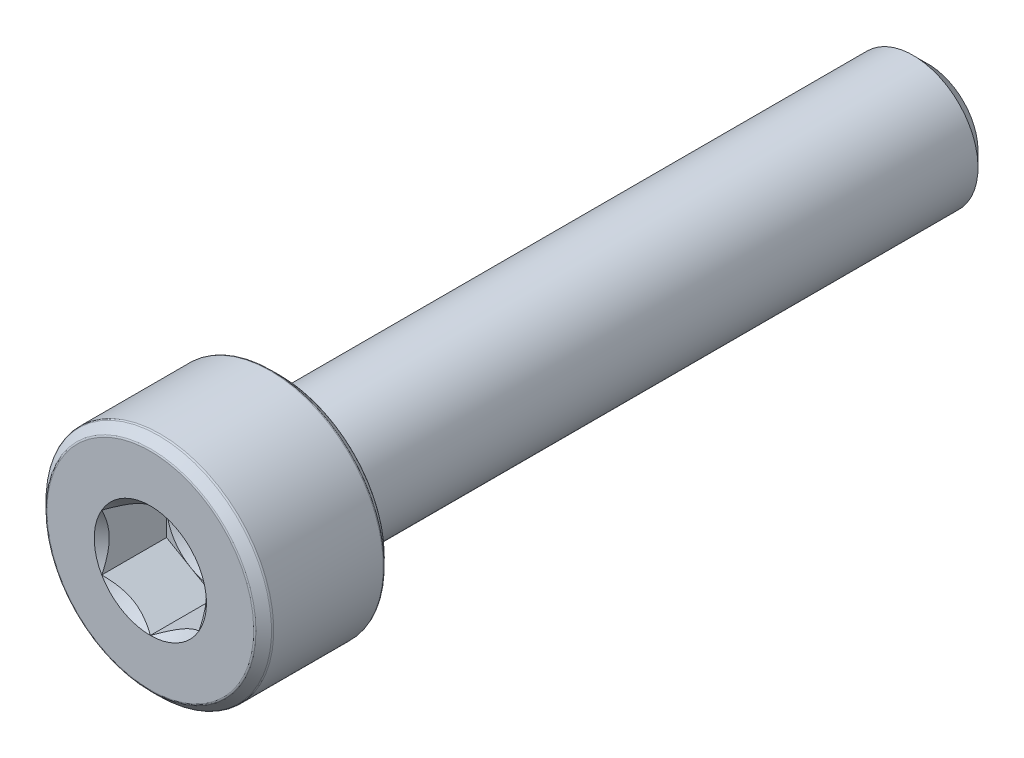
ISO-10303-21;
HEADER;
FILE_DESCRIPTION(('STEP AP214'),'2;1');
FILE_NAME('part.step','',(''),(''),'','','');
FILE_SCHEMA(('AUTOMOTIVE_DESIGN { 1 0 10303 214 1 1 1 1 }'));
ENDSEC;
DATA;
#1=APPLICATION_CONTEXT('core data for automotive mechanical design processes');
#2=APPLICATION_PROTOCOL_DEFINITION('international standard','automotive_design',2000,#1);
#3=PRODUCT_CONTEXT('',#1,'mechanical');
#4=PRODUCT('Part','Part','',(#3));
#5=PRODUCT_RELATED_PRODUCT_CATEGORY('part','',(#4));
#6=PRODUCT_DEFINITION_FORMATION('','',#4);
#7=PRODUCT_DEFINITION_CONTEXT('part definition',#1,'design');
#8=PRODUCT_DEFINITION('design','',#6,#7);
#9=PRODUCT_DEFINITION_SHAPE('','',#8);
#10=(LENGTH_UNIT() NAMED_UNIT(*) SI_UNIT(.MILLI.,.METRE.));
#11=(NAMED_UNIT(*) PLANE_ANGLE_UNIT() SI_UNIT($,.RADIAN.));
#12=(NAMED_UNIT(*) SI_UNIT($,.STERADIAN.) SOLID_ANGLE_UNIT());
#13=UNCERTAINTY_MEASURE_WITH_UNIT(LENGTH_MEASURE(1.E-05),#10,'distance_accuracy_value','');
#14=(GEOMETRIC_REPRESENTATION_CONTEXT(3) GLOBAL_UNCERTAINTY_ASSIGNED_CONTEXT((#13)) GLOBAL_UNIT_ASSIGNED_CONTEXT((#10,
#11,#12)) REPRESENTATION_CONTEXT('',''));
#15=CARTESIAN_POINT('',(0.,0.,0.));
#16=DIRECTION('',(0.,0.,1.));
#17=DIRECTION('',(1.,0.,0.));
#18=AXIS2_PLACEMENT_3D('',#15,#16,#17);
#19=CARTESIAN_POINT('',(0.,1.5,10.));
#20=DIRECTION('',(0.,0.,-1.));
#21=DIRECTION('',(0.,1.,0.));
#22=AXIS2_PLACEMENT_3D('',#19,#20,#21);
#23=PLANE('',#22);
#24=DIRECTION('',(-0.866025403784439,0.5,0.));
#25=VECTOR('',#24,1.);
#26=CARTESIAN_POINT('',(1.5,0.866025403784438,10.));
#27=LINE('',#26,#25);
#28=CARTESIAN_POINT('',(1.5,0.866025403784438,10.));
#29=VERTEX_POINT('',#28);
#30=CARTESIAN_POINT('',(0.749999999999999,1.29903810567666,10.));
#31=VERTEX_POINT('',#30);
#32=EDGE_CURVE('E315',#29,#31,#27,.T.);
#33=ORIENTED_EDGE('',*,*,#32,.T.);
#34=CARTESIAN_POINT('',(0.,0.,10.));
#35=DIRECTION('',(0.,0.,1.));
#36=DIRECTION('',(1.,0.,0.));
#37=AXIS2_PLACEMENT_3D('',#34,#35,#36);
#38=CIRCLE('',#37,1.5);
#39=CARTESIAN_POINT('',(1.5,0.,10.));
#40=VERTEX_POINT('',#39);
#41=EDGE_CURVE('E58',#40,#31,#38,.T.);
#42=ORIENTED_EDGE('',*,*,#41,.F.);
#43=DIRECTION('',(0.,1.,0.));
#44=VECTOR('',#43,1.);
#45=CARTESIAN_POINT('',(1.5,-0.866025403784438,10.));
#46=LINE('',#45,#44);
#47=EDGE_CURVE('E65',#40,#29,#46,.T.);
#48=ORIENTED_EDGE('',*,*,#47,.T.);
#49=EDGE_LOOP('',(#33,#42,#48));
#50=FACE_BOUND('',#49,.T.);
#51=ADVANCED_FACE('F41',(#50),#23,.F.);
#52=CARTESIAN_POINT('',(1.5,-0.866025403784438,10.));
#53=VERTEX_POINT('',#52);
#54=EDGE_CURVE('E195',#53,#40,#46,.T.);
#55=ORIENTED_EDGE('',*,*,#54,.T.);
#56=CARTESIAN_POINT('',(0.,0.,10.));
#57=DIRECTION('',(0.,0.,-1.));
#58=DIRECTION('',(0.,1.,0.));
#59=AXIS2_PLACEMENT_3D('',#56,#57,#58);
#60=CIRCLE('',#59,1.5);
#61=CARTESIAN_POINT('',(0.75,-1.29903810567666,10.));
#62=VERTEX_POINT('',#61);
#63=EDGE_CURVE('E11',#40,#62,#60,.T.);
#64=ORIENTED_EDGE('',*,*,#63,.T.);
#65=DIRECTION('',(0.866025403784439,0.5,0.));
#66=VECTOR('',#65,1.);
#67=CARTESIAN_POINT('',(0.,-1.73205080756888,10.));
#68=LINE('',#67,#66);
#69=EDGE_CURVE('E190',#62,#53,#68,.T.);
#70=ORIENTED_EDGE('',*,*,#69,.T.);
#71=EDGE_LOOP('',(#55,#64,#70));
#72=FACE_BOUND('',#71,.T.);
#73=ADVANCED_FACE('F129',(#72),#23,.F.);
#74=CARTESIAN_POINT('',(0.,-1.73205080756888,10.));
#75=VERTEX_POINT('',#74);
#76=EDGE_CURVE('E191',#75,#62,#68,.T.);
#77=ORIENTED_EDGE('',*,*,#76,.T.);
#78=CARTESIAN_POINT('',(-0.75,-1.29903810567666,10.));
#79=VERTEX_POINT('',#78);
#80=EDGE_CURVE('E51',#62,#79,#60,.T.);
#81=ORIENTED_EDGE('',*,*,#80,.T.);
#82=DIRECTION('',(0.866025403784439,-0.5,0.));
#83=VECTOR('',#82,1.);
#84=CARTESIAN_POINT('',(-1.5,-0.866025403784438,10.));
#85=LINE('',#84,#83);
#86=EDGE_CURVE('E177',#79,#75,#85,.T.);
#87=ORIENTED_EDGE('',*,*,#86,.T.);
#88=EDGE_LOOP('',(#77,#81,#87));
#89=FACE_BOUND('',#88,.T.);
#90=ADVANCED_FACE('F135',(#89),#23,.F.);
#91=CARTESIAN_POINT('',(-1.5,-0.866025403784438,10.));
#92=VERTEX_POINT('',#91);
#93=EDGE_CURVE('E182',#92,#79,#85,.T.);
#94=ORIENTED_EDGE('',*,*,#93,.T.);
#95=CARTESIAN_POINT('',(-1.5,0.,10.));
#96=VERTEX_POINT('',#95);
#97=EDGE_CURVE('E269',#79,#96,#60,.T.);
#98=ORIENTED_EDGE('',*,*,#97,.T.);
#99=DIRECTION('',(0.,-1.,0.));
#100=VECTOR('',#99,1.);
#101=CARTESIAN_POINT('',(-1.5,0.866025403784439,10.));
#102=LINE('',#101,#100);
#103=EDGE_CURVE('E178',#96,#92,#102,.T.);
#104=ORIENTED_EDGE('',*,*,#103,.T.);
#105=EDGE_LOOP('',(#94,#98,#104));
#106=FACE_BOUND('',#105,.T.);
#107=ADVANCED_FACE('F155',(#106),#23,.F.);
#108=CARTESIAN_POINT('',(-1.5,0.866025403784439,10.));
#109=VERTEX_POINT('',#108);
#110=EDGE_CURVE('E168',#109,#96,#102,.T.);
#111=ORIENTED_EDGE('',*,*,#110,.T.);
#112=CARTESIAN_POINT('',(-0.75,1.29903810567666,10.));
#113=VERTEX_POINT('',#112);
#114=EDGE_CURVE('E169',#96,#113,#60,.T.);
#115=ORIENTED_EDGE('',*,*,#114,.T.);
#116=DIRECTION('',(-0.866025403784439,-0.5,0.));
#117=VECTOR('',#116,1.);
#118=CARTESIAN_POINT('',(0.,1.73205080756888,10.));
#119=LINE('',#118,#117);
#120=EDGE_CURVE('E171',#113,#109,#119,.T.);
#121=ORIENTED_EDGE('',*,*,#120,.T.);
#122=EDGE_LOOP('',(#111,#115,#121));
#123=FACE_BOUND('',#122,.T.);
#124=ADVANCED_FACE('F142',(#123),#23,.F.);
#125=CARTESIAN_POINT('',(0.,3.19100505063389,12.));
#126=DIRECTION('',(0.,0.,-1.));
#127=DIRECTION('',(0.,1.,0.));
#128=AXIS2_PLACEMENT_3D('',#125,#126,#127);
#129=PLANE('',#128);
#130=CARTESIAN_POINT('',(0.,0.,12.));
#131=DIRECTION('',(0.,0.,1.));
#132=DIRECTION('',(1.,0.,0.));
#133=AXIS2_PLACEMENT_3D('',#130,#131,#132);
#134=CIRCLE('',#133,1.73205080756888);
#135=CARTESIAN_POINT('',(0.,1.73205080756888,12.));
#136=VERTEX_POINT('',#135);
#137=CARTESIAN_POINT('',(-1.5,0.866025403784439,12.));
#138=VERTEX_POINT('',#137);
#139=EDGE_CURVE('E292',#136,#138,#134,.T.);
#140=ORIENTED_EDGE('',*,*,#139,.F.);
#141=CARTESIAN_POINT('',(0.,0.,12.));
#142=DIRECTION('',(0.,0.,1.));
#143=DIRECTION('',(1.,0.,0.));
#144=AXIS2_PLACEMENT_3D('',#141,#142,#143);
#145=CIRCLE('',#144,1.73205080756888);
#146=CARTESIAN_POINT('',(1.5,0.866025403784438,12.));
#147=VERTEX_POINT('',#146);
#148=EDGE_CURVE('E386',#147,#136,#145,.T.);
#149=ORIENTED_EDGE('',*,*,#148,.F.);
#150=CARTESIAN_POINT('',(0.,0.,12.));
#151=DIRECTION('',(0.,0.,1.));
#152=DIRECTION('',(1.,0.,0.));
#153=AXIS2_PLACEMENT_3D('',#150,#151,#152);
#154=CIRCLE('',#153,1.73205080756888);
#155=CARTESIAN_POINT('',(1.5,-0.866025403784437,12.));
#156=VERTEX_POINT('',#155);
#157=EDGE_CURVE('E320',#156,#147,#154,.T.);
#158=ORIENTED_EDGE('',*,*,#157,.F.);
#159=CARTESIAN_POINT('',(0.,0.,12.));
#160=DIRECTION('',(0.,0.,1.));
#161=DIRECTION('',(1.,0.,0.));
#162=AXIS2_PLACEMENT_3D('',#159,#160,#161);
#163=CIRCLE('',#162,1.73205080756888);
#164=CARTESIAN_POINT('',(0.,-1.73205080756888,12.));
#165=VERTEX_POINT('',#164);
#166=EDGE_CURVE('E359',#165,#156,#163,.T.);
#167=ORIENTED_EDGE('',*,*,#166,.F.);
#168=CARTESIAN_POINT('',(0.,0.,12.));
#169=DIRECTION('',(0.,0.,1.));
#170=DIRECTION('',(1.,0.,0.));
#171=AXIS2_PLACEMENT_3D('',#168,#169,#170);
#172=CIRCLE('',#171,1.73205080756888);
#173=CARTESIAN_POINT('',(-1.5,-0.866025403784438,12.));
#174=VERTEX_POINT('',#173);
#175=EDGE_CURVE('E291',#174,#165,#172,.T.);
#176=ORIENTED_EDGE('',*,*,#175,.F.);
#177=CARTESIAN_POINT('',(0.,0.,12.));
#178=DIRECTION('',(0.,0.,1.));
#179=DIRECTION('',(1.,0.,0.));
#180=AXIS2_PLACEMENT_3D('',#177,#178,#179);
#181=CIRCLE('',#180,1.73205080756888);
#182=EDGE_CURVE('E376',#138,#174,#181,.T.);
#183=ORIENTED_EDGE('',*,*,#182,.F.);
#184=EDGE_LOOP('',(#140,#149,#158,#167,#176,#183));
#185=FACE_BOUND('',#184,.T.);
#186=CARTESIAN_POINT('',(0.,0.,12.));
#187=DIRECTION('',(0.,0.,1.));
#188=DIRECTION('',(0.,-1.,0.));
#189=AXIS2_PLACEMENT_3D('',#186,#187,#188);
#190=CIRCLE('',#189,3.19100505063388);
#191=CARTESIAN_POINT('',(0.,-3.19100505063388,12.));
#192=VERTEX_POINT('',#191);
#193=EDGE_CURVE('E261',#192,#192,#190,.T.);
#194=ORIENTED_EDGE('',*,*,#193,.T.);
#195=EDGE_LOOP('',(#194));
#196=FACE_BOUND('',#195,.T.);
#197=ADVANCED_FACE('F43',(#185,#196),#129,.F.);
#198=CARTESIAN_POINT('',(0.,0.,11.93));
#199=DIRECTION('',(0.,0.,1.));
#200=DIRECTION('',(0.,-1.,0.));
#201=AXIS2_PLACEMENT_3D('',#198,#199,#200);
#202=TOROIDAL_SURFACE('',#201,3.19100505063388,0.0699999999999999);
#203=ORIENTED_EDGE('',*,*,#193,.F.);
#204=EDGE_LOOP('',(#203));
#205=FACE_BOUND('',#204,.T.);
#206=CARTESIAN_POINT('',(0.,0.,11.9794974746831));
#207=DIRECTION('',(0.,0.,1.));
#208=DIRECTION('',(0.,-1.,0.));
#209=AXIS2_PLACEMENT_3D('',#206,#207,#208);
#210=CIRCLE('',#209,3.24050252531694);
#211=CARTESIAN_POINT('',(0.,-3.24050252531694,11.9794974746831));
#212=VERTEX_POINT('',#211);
#213=EDGE_CURVE('E258',#212,#212,#210,.T.);
#214=ORIENTED_EDGE('',*,*,#213,.T.);
#215=EDGE_LOOP('',(#214));
#216=FACE_BOUND('',#215,.T.);
#217=ADVANCED_FACE('F162',(#205,#216),#202,.T.);
#218=CARTESIAN_POINT('',(0.,0.,11.7405025253169));
#219=DIRECTION('',(0.,0.,-1.));
#220=DIRECTION('',(0.,1.,0.));
#221=AXIS2_PLACEMENT_3D('',#218,#219,#220);
#222=CONICAL_SURFACE('',#221,3.47949747468306,0.785398163397458);
#223=ORIENTED_EDGE('',*,*,#213,.F.);
#224=EDGE_LOOP('',(#223));
#225=FACE_BOUND('',#224,.T.);
#226=CARTESIAN_POINT('',(0.,0.,11.7405025253169));
#227=DIRECTION('',(0.,0.,1.));
#228=DIRECTION('',(0.,-1.,0.));
#229=AXIS2_PLACEMENT_3D('',#226,#227,#228);
#230=CIRCLE('',#229,3.47949747468306);
#231=CARTESIAN_POINT('',(0.,-3.47949747468306,11.7405025253169));
#232=VERTEX_POINT('',#231);
#233=EDGE_CURVE('E254',#232,#232,#230,.T.);
#234=ORIENTED_EDGE('',*,*,#233,.T.);
#235=EDGE_LOOP('',(#234));
#236=FACE_BOUND('',#235,.T.);
#237=ADVANCED_FACE('F546',(#225,#236),#222,.T.);
#238=CARTESIAN_POINT('',(0.,0.,11.6910050506339));
#239=DIRECTION('',(0.,0.,1.));
#240=DIRECTION('',(0.,-1.,0.));
#241=AXIS2_PLACEMENT_3D('',#238,#239,#240);
#242=TOROIDAL_SURFACE('',#241,3.43,0.0700000000000011);
#243=ORIENTED_EDGE('',*,*,#233,.F.);
#244=EDGE_LOOP('',(#243));
#245=FACE_BOUND('',#244,.T.);
#246=CARTESIAN_POINT('',(0.,0.,11.6910050506339));
#247=DIRECTION('',(0.,0.,1.));
#248=DIRECTION('',(0.,-1.,0.));
#249=AXIS2_PLACEMENT_3D('',#246,#247,#248);
#250=CIRCLE('',#249,3.5);
#251=CARTESIAN_POINT('',(0.,-3.5,11.6910050506339));
#252=VERTEX_POINT('',#251);
#253=EDGE_CURVE('E250',#252,#252,#250,.T.);
#254=ORIENTED_EDGE('',*,*,#253,.T.);
#255=EDGE_LOOP('',(#254));
#256=FACE_BOUND('',#255,.T.);
#257=ADVANCED_FACE('F538',(#245,#256),#242,.T.);
#258=CARTESIAN_POINT('',(0.,0.,12.));
#259=DIRECTION('',(0.,0.,1.));
#260=DIRECTION('',(0.,-1.,0.));
#261=AXIS2_PLACEMENT_3D('',#258,#259,#260);
#262=CYLINDRICAL_SURFACE('',#261,3.5);
#263=ORIENTED_EDGE('',*,*,#253,.F.);
#264=EDGE_LOOP('',(#263));
#265=FACE_BOUND('',#264,.T.);
#266=CARTESIAN_POINT('',(0.,0.,8.30899494936612));
#267=DIRECTION('',(0.,0.,1.));
#268=DIRECTION('',(0.,-1.,0.));
#269=AXIS2_PLACEMENT_3D('',#266,#267,#268);
#270=CIRCLE('',#269,3.5);
#271=CARTESIAN_POINT('',(0.,-3.5,8.30899494936612));
#272=VERTEX_POINT('',#271);
#273=EDGE_CURVE('E246',#272,#272,#270,.T.);
#274=ORIENTED_EDGE('',*,*,#273,.T.);
#275=EDGE_LOOP('',(#274));
#276=FACE_BOUND('',#275,.T.);
#277=ADVANCED_FACE('F530',(#265,#276),#262,.T.);
#278=CARTESIAN_POINT('',(0.,0.,8.30899494936611));
#279=DIRECTION('',(0.,0.,1.));
#280=DIRECTION('',(0.,-1.,0.));
#281=AXIS2_PLACEMENT_3D('',#278,#279,#280);
#282=TOROIDAL_SURFACE('',#281,3.43,0.0699999999999992);
#283=ORIENTED_EDGE('',*,*,#273,.F.);
#284=EDGE_LOOP('',(#283));
#285=FACE_BOUND('',#284,.T.);
#286=CARTESIAN_POINT('',(0.,0.,8.25949747468306));
#287=DIRECTION('',(0.,0.,1.));
#288=DIRECTION('',(0.,-1.,0.));
#289=AXIS2_PLACEMENT_3D('',#286,#287,#288);
#290=CIRCLE('',#289,3.47949747468306);
#291=CARTESIAN_POINT('',(0.,-3.47949747468306,8.25949747468306));
#292=VERTEX_POINT('',#291);
#293=EDGE_CURVE('E242',#292,#292,#290,.T.);
#294=ORIENTED_EDGE('',*,*,#293,.T.);
#295=EDGE_LOOP('',(#294));
#296=FACE_BOUND('',#295,.T.);
#297=ADVANCED_FACE('F522',(#285,#296),#282,.T.);
#298=CARTESIAN_POINT('',(0.,0.,8.02050252531694));
#299=DIRECTION('',(0.,0.,1.));
#300=DIRECTION('',(0.,-1.,0.));
#301=AXIS2_PLACEMENT_3D('',#298,#299,#300);
#302=CONICAL_SURFACE('',#301,3.24050252531694,0.785398163397452);
#303=ORIENTED_EDGE('',*,*,#293,.F.);
#304=EDGE_LOOP('',(#303));
#305=FACE_BOUND('',#304,.T.);
#306=CARTESIAN_POINT('',(0.,0.,8.02050252531694));
#307=DIRECTION('',(0.,0.,1.));
#308=DIRECTION('',(0.,-1.,0.));
#309=AXIS2_PLACEMENT_3D('',#306,#307,#308);
#310=CIRCLE('',#309,3.24050252531694);
#311=CARTESIAN_POINT('',(0.,-3.24050252531694,8.02050252531694));
#312=VERTEX_POINT('',#311);
#313=EDGE_CURVE('E238',#312,#312,#310,.T.);
#314=ORIENTED_EDGE('',*,*,#313,.T.);
#315=EDGE_LOOP('',(#314));
#316=FACE_BOUND('',#315,.T.);
#317=ADVANCED_FACE('F514',(#305,#316),#302,.T.);
#318=CARTESIAN_POINT('',(0.,0.,8.07));
#319=DIRECTION('',(0.,0.,1.));
#320=DIRECTION('',(0.,-1.,0.));
#321=AXIS2_PLACEMENT_3D('',#318,#319,#320);
#322=TOROIDAL_SURFACE('',#321,3.19100505063389,0.0699999999999983);
#323=ORIENTED_EDGE('',*,*,#313,.F.);
#324=EDGE_LOOP('',(#323));
#325=FACE_BOUND('',#324,.T.);
#326=CARTESIAN_POINT('',(0.,0.,8.));
#327=DIRECTION('',(0.,0.,1.));
#328=DIRECTION('',(0.,-1.,0.));
#329=AXIS2_PLACEMENT_3D('',#326,#327,#328);
#330=CIRCLE('',#329,3.19100505063389);
#331=CARTESIAN_POINT('',(0.,-3.19100505063389,8.));
#332=VERTEX_POINT('',#331);
#333=EDGE_CURVE('E234',#332,#332,#330,.T.);
#334=ORIENTED_EDGE('',*,*,#333,.T.);
#335=EDGE_LOOP('',(#334));
#336=FACE_BOUND('',#335,.T.);
#337=ADVANCED_FACE('F506',(#325,#336),#322,.T.);
#338=CARTESIAN_POINT('',(0.,2.,8.));
#339=DIRECTION('',(0.,0.,1.));
#340=DIRECTION('',(0.,-1.,0.));
#341=AXIS2_PLACEMENT_3D('',#338,#339,#340);
#342=PLANE('',#341);
#343=ORIENTED_EDGE('',*,*,#333,.F.);
#344=EDGE_LOOP('',(#343));
#345=FACE_BOUND('',#344,.T.);
#346=CARTESIAN_POINT('',(0.,0.,8.));
#347=DIRECTION('',(0.,0.,1.));
#348=DIRECTION('',(0.,-1.,0.));
#349=AXIS2_PLACEMENT_3D('',#346,#347,#348);
#350=CIRCLE('',#349,2.);
#351=CARTESIAN_POINT('',(0.,-2.,8.));
#352=VERTEX_POINT('',#351);
#353=EDGE_CURVE('E230',#352,#352,#350,.T.);
#354=ORIENTED_EDGE('',*,*,#353,.T.);
#355=EDGE_LOOP('',(#354));
#356=FACE_BOUND('',#355,.T.);
#357=ADVANCED_FACE('F498',(#345,#356),#342,.F.);
#358=CARTESIAN_POINT('',(0.,0.,12.));
#359=DIRECTION('',(0.,0.,1.));
#360=DIRECTION('',(0.,-1.,0.));
#361=AXIS2_PLACEMENT_3D('',#358,#359,#360);
#362=CYLINDRICAL_SURFACE('',#361,2.);
#363=ORIENTED_EDGE('',*,*,#353,.F.);
#364=EDGE_LOOP('',(#363));
#365=FACE_BOUND('',#364,.T.);
#366=CARTESIAN_POINT('',(0.,0.,-11.5453366630132));
#367=DIRECTION('',(0.,0.,1.));
#368=DIRECTION('',(0.,-1.,0.));
#369=AXIS2_PLACEMENT_3D('',#366,#367,#368);
#370=CIRCLE('',#369,2.);
#371=CARTESIAN_POINT('',(0.,-2.,-11.5453366630132));
#372=VERTEX_POINT('',#371);
#373=EDGE_CURVE('E226',#372,#372,#370,.T.);
#374=ORIENTED_EDGE('',*,*,#373,.T.);
#375=EDGE_LOOP('',(#374));
#376=FACE_BOUND('',#375,.T.);
#377=ADVANCED_FACE('F490',(#365,#376),#362,.T.);
#378=CARTESIAN_POINT('',(0.,0.,-12.));
#379=DIRECTION('',(0.,0.,1.));
#380=DIRECTION('',(0.,-1.,0.));
#381=AXIS2_PLACEMENT_3D('',#378,#379,#380);
#382=CONICAL_SURFACE('',#381,1.54533666301317,0.785398163397448);
#383=ORIENTED_EDGE('',*,*,#373,.F.);
#384=EDGE_LOOP('',(#383));
#385=FACE_BOUND('',#384,.T.);
#386=CARTESIAN_POINT('',(0.,0.,-12.));
#387=DIRECTION('',(0.,0.,1.));
#388=DIRECTION('',(0.,-1.,0.));
#389=AXIS2_PLACEMENT_3D('',#386,#387,#388);
#390=CIRCLE('',#389,1.54533666301317);
#391=CARTESIAN_POINT('',(0.,-1.54533666301316,-12.));
#392=VERTEX_POINT('',#391);
#393=EDGE_CURVE('E204',#392,#392,#390,.T.);
#394=ORIENTED_EDGE('',*,*,#393,.T.);
#395=EDGE_LOOP('',(#394));
#396=FACE_BOUND('',#395,.T.);
#397=ADVANCED_FACE('F482',(#385,#396),#382,.T.);
#398=CARTESIAN_POINT('',(0.,0.,-12.));
#399=DIRECTION('',(0.,0.,1.));
#400=DIRECTION('',(0.,-1.,0.));
#401=AXIS2_PLACEMENT_3D('',#398,#399,#400);
#402=PLANE('',#401);
#403=ORIENTED_EDGE('',*,*,#393,.F.);
#404=EDGE_LOOP('',(#403));
#405=FACE_BOUND('',#404,.T.);
#406=ADVANCED_FACE('F478',(#405),#402,.F.);
#407=CARTESIAN_POINT('',(1.5,0.866025403784438,10.));
#408=DIRECTION('',(0.5,0.866025403784439,0.));
#409=DIRECTION('',(-0.866025403784439,0.5,0.));
#410=AXIS2_PLACEMENT_3D('',#407,#408,#409);
#411=PLANE('',#410);
#412=DIRECTION('',(0.,0.,1.));
#413=VECTOR('',#412,1.);
#414=CARTESIAN_POINT('',(1.5,0.866025403784438,10.));
#415=LINE('',#414,#413);
#416=EDGE_CURVE('E200',#29,#147,#415,.T.);
#417=ORIENTED_EDGE('',*,*,#416,.T.);
#418=CARTESIAN_POINT('',(-0.0002,1.73216627762271,12.0001154816001));
#419=CARTESIAN_POINT('',(0.0513677907370755,1.70239359975915,11.9703654760673));
#420=CARTESIAN_POINT('',(0.103797917665201,1.67212305186355,11.9423624839103));
#421=CARTESIAN_POINT('',(0.210709034055597,1.61039789003619,11.8910892304401));
#422=CARTESIAN_POINT('',(0.265200195814661,1.57893740312614,11.8678475050444));
#423=CARTESIAN_POINT('',(0.375079081357249,1.51549879897987,11.8280337289922));
#424=CARTESIAN_POINT('',(0.4304388090952,1.4835368452681,11.8113615856709));
#425=CARTESIAN_POINT('',(0.542377257477151,1.41890915196211,11.7856744568181));
#426=CARTESIAN_POINT('',(0.598952556553009,1.38624538781118,11.7766402904789));
#427=CARTESIAN_POINT('',(0.696455389516441,1.32995210095299,11.7684890812269));
#428=CARTESIAN_POINT('',(0.737256908280466,1.30639533311124,11.7672822529892));
#429=CARTESIAN_POINT('',(0.818787969615858,1.25932335290193,11.7693140571623));
#430=CARTESIAN_POINT('',(0.85951749431463,1.23580815085313,11.7725536707483));
#431=CARTESIAN_POINT('',(0.940584402163416,1.18900414978427,11.783291985982));
#432=CARTESIAN_POINT('',(0.980921384598288,1.16571558211719,11.7907946530187));
#433=CARTESIAN_POINT('',(1.06091833691403,1.11952932016335,11.8096516119283));
#434=CARTESIAN_POINT('',(1.10057800851621,1.09663179808786,11.8210075570186));
#435=CARTESIAN_POINT('',(1.20216313477448,1.03798159809698,11.8547216475927));
#436=CARTESIAN_POINT('',(1.26345855370969,1.00259267147465,11.8796218490934));
#437=CARTESIAN_POINT('',(1.35358562846331,0.950557780604374,11.9216566532716));
#438=CARTESIAN_POINT('',(1.38328513990772,0.933410759677147,11.9364251535591));
#439=CARTESIAN_POINT('',(1.44213790138375,0.899432101996406,11.9673105659402));
#440=CARTESIAN_POINT('',(1.47129140422064,0.882600319285709,11.9834268341217));
#441=CARTESIAN_POINT('',(1.5002,0.865909933730601,12.0001154816001));
#442=B_SPLINE_CURVE_WITH_KNOTS('',3,(#418,#419,#420,#421,#422,#423,#424,#425,#426,#427,#428,
#429,#430,#431,#432,#433,#434,#435,#436,#437,#438,#439,#440,#441),.UNSPECIFIED.,.F.,.F.,(4,2,2,
2,2,2,2,2,2,2,2,4),(0.,0.199829143693305,0.400822987382389,0.598623720538181,0.795926240188889,
0.937113067959881,1.07833105577193,1.21968061668222,1.36109089931054,1.58570969637565,
1.69770705470964,1.80965120737194),.UNSPECIFIED.);
#443=EDGE_CURVE('E313',#136,#147,#442,.T.);
#444=ORIENTED_EDGE('',*,*,#443,.F.);
#445=DIRECTION('',(0.,0.,1.));
#446=VECTOR('',#445,1.);
#447=CARTESIAN_POINT('',(0.,1.73205080756888,10.));
#448=LINE('',#447,#446);
#449=CARTESIAN_POINT('',(0.,1.73205080756888,10.));
#450=VERTEX_POINT('',#449);
#451=EDGE_CURVE('E199',#450,#136,#448,.T.);
#452=ORIENTED_EDGE('',*,*,#451,.F.);
#453=EDGE_CURVE('E316',#31,#450,#27,.T.);
#454=ORIENTED_EDGE('',*,*,#453,.F.);
#455=ORIENTED_EDGE('',*,*,#32,.F.);
#456=EDGE_LOOP('',(#417,#444,#452,#454,#455));
#457=FACE_BOUND('',#456,.T.);
#458=ADVANCED_FACE('F311',(#457),#411,.F.);
#459=CARTESIAN_POINT('',(1.5,-0.866025403784438,10.));
#460=DIRECTION('',(1.,0.,0.));
#461=DIRECTION('',(0.,1.,0.));
#462=AXIS2_PLACEMENT_3D('',#459,#460,#461);
#463=PLANE('',#462);
#464=DIRECTION('',(0.,0.,1.));
#465=VECTOR('',#464,1.);
#466=CARTESIAN_POINT('',(1.5,-0.866025403784438,10.));
#467=LINE('',#466,#465);
#468=EDGE_CURVE('E205',#53,#156,#467,.T.);
#469=ORIENTED_EDGE('',*,*,#468,.T.);
#470=CARTESIAN_POINT('',(1.5,-1.72720812969692,12.5555785162708));
#471=CARTESIAN_POINT('',(1.5,-1.68515175699268,12.5238299078574));
#472=CARTESIAN_POINT('',(1.5,-1.64286104748673,12.4923925938074));
#473=CARTESIAN_POINT('',(1.5,-1.55771581035942,12.4302690875564));
#474=CARTESIAN_POINT('',(1.5,-1.51486114386668,12.3995830858922));
#475=CARTESIAN_POINT('',(1.5,-1.3846813415127,12.3084071924272));
#476=CARTESIAN_POINT('',(1.5,-1.29637976071653,12.2492883434268));
#477=CARTESIAN_POINT('',(1.5,-1.11121478730467,12.1332309963165));
#478=CARTESIAN_POINT('',(1.5,-1.01415038238167,12.076609558733));
#479=CARTESIAN_POINT('',(1.5,-0.815173408897604,11.9730368812657));
#480=CARTESIAN_POINT('',(1.5,-0.713278669253284,11.9260530415417));
#481=CARTESIAN_POINT('',(1.5,-0.56033377494311,11.8685726684308));
#482=CARTESIAN_POINT('',(1.5,-0.511547982948041,11.8520753877572));
#483=CARTESIAN_POINT('',(1.5,-0.412798620136866,11.822997512927));
#484=CARTESIAN_POINT('',(1.5,-0.362834968437562,11.810417188594));
#485=CARTESIAN_POINT('',(1.5,-0.262863235444981,11.7900361941468));
#486=CARTESIAN_POINT('',(1.5,-0.212872113808022,11.782153632746));
#487=CARTESIAN_POINT('',(1.5,-0.112355243569545,11.771322063969));
#488=CARTESIAN_POINT('',(1.5,-0.0618295883726282,11.7683722085244));
#489=CARTESIAN_POINT('',(1.5,0.0374291733323837,11.7676248577249));
#490=CARTESIAN_POINT('',(1.5,0.0861609672002986,11.7696447335581));
#491=CARTESIAN_POINT('',(1.5,0.183206937768827,11.7783225528968));
#492=CARTESIAN_POINT('',(1.5,0.231521073438269,11.7849809469685));
#493=CARTESIAN_POINT('',(1.5,0.328199853425436,11.8026852441226));
#494=CARTESIAN_POINT('',(1.5,0.376550616310328,11.813805811257));
#495=CARTESIAN_POINT('',(1.5,0.472195697125598,11.8398434140487));
#496=CARTESIAN_POINT('',(1.5,0.51949010309274,11.8547601320409));
#497=CARTESIAN_POINT('',(1.5,0.668391282696624,11.9073352235961));
#498=CARTESIAN_POINT('',(1.5,0.767878709508552,11.950981287472));
#499=CARTESIAN_POINT('',(1.5,0.962179866690723,12.0480229945931));
#500=CARTESIAN_POINT('',(1.5,1.05697519961444,12.1014536650895));
#501=CARTESIAN_POINT('',(1.5,1.23814273533383,12.2116858520046));
#502=CARTESIAN_POINT('',(1.5,1.3246994218129,12.2681879206986));
#503=CARTESIAN_POINT('',(1.5,1.45222331290673,12.3555343015787));
#504=CARTESIAN_POINT('',(1.5,1.49418091978756,12.38495775868));
#505=CARTESIAN_POINT('',(1.5,1.57752272931476,12.4445828218305));
#506=CARTESIAN_POINT('',(1.5,1.61890708647354,12.4747842116644));
#507=CARTESIAN_POINT('',(1.5,1.66005278019494,12.5053081786095));
#508=B_SPLINE_CURVE_WITH_KNOTS('',3,(#470,#471,#472,#473,#474,#475,#476,#477,#478,#479,#480,
#481,#482,#483,#484,#485,#486,#487,#488,#489,#490,#491,#492,#493,#494,#495,#496,#497,#498,#499,
#500,#501,#502,#503,#504,#505,#506,#507),.UNSPECIFIED.,.F.,.F.,(4,2,2,2,2,2,2,2,2,2,2,2,2,2,2,2,
2,2,4),(0.,0.158079548982667,0.316198780993941,0.634850417346958,0.971690311361509,
1.30737131660667,1.46173961127089,1.61611853740677,1.76772101421409,1.91929742368538,
2.065387412096,2.21149159305544,2.36014984633872,2.50879566386709,2.83376031422673,
3.15991186985651,3.46985601802197,3.62358896039973,3.7772796264207),.UNSPECIFIED.);
#509=EDGE_CURVE('E308',#147,#156,#508,.F.);
#510=ORIENTED_EDGE('',*,*,#509,.F.);
#511=ORIENTED_EDGE('',*,*,#416,.F.);
#512=ORIENTED_EDGE('',*,*,#47,.F.);
#513=ORIENTED_EDGE('',*,*,#54,.F.);
#514=EDGE_LOOP('',(#469,#510,#511,#512,#513));
#515=FACE_BOUND('',#514,.T.);
#516=ADVANCED_FACE('F305',(#515),#463,.F.);
#517=CARTESIAN_POINT('',(0.,-1.73205080756888,10.));
#518=DIRECTION('',(0.5,-0.866025403784439,0.));
#519=DIRECTION('',(0.866025403784439,0.5,0.));
#520=AXIS2_PLACEMENT_3D('',#517,#518,#519);
#521=PLANE('',#520);
#522=DIRECTION('',(0.,0.,1.));
#523=VECTOR('',#522,1.);
#524=CARTESIAN_POINT('',(0.,-1.73205080756888,10.));
#525=LINE('',#524,#523);
#526=EDGE_CURVE('E209',#75,#165,#525,.T.);
#527=ORIENTED_EDGE('',*,*,#526,.T.);
#528=CARTESIAN_POINT('',(1.5002,-0.8659099337306,12.0001154816001));
#529=CARTESIAN_POINT('',(1.44863220926292,-0.895682611594165,11.9703654760673));
#530=CARTESIAN_POINT('',(1.3962020823348,-0.925953159489764,11.9423624839103));
#531=CARTESIAN_POINT('',(1.2892909659444,-0.987678321317123,11.8910892304401));
#532=CARTESIAN_POINT('',(1.23479980418534,-1.01913880822717,11.8678475050444));
#533=CARTESIAN_POINT('',(1.12492091864275,-1.08257741237344,11.8280337289922));
#534=CARTESIAN_POINT('',(1.0695611909048,-1.11453936608521,11.8113615856709));
#535=CARTESIAN_POINT('',(0.957622742522849,-1.1791670593912,11.7856744568181));
#536=CARTESIAN_POINT('',(0.901047443446991,-1.21183082354213,11.7766402904789));
#537=CARTESIAN_POINT('',(0.803544610483559,-1.26812411040032,11.7684890812269));
#538=CARTESIAN_POINT('',(0.762743091719533,-1.29168087824208,11.7672822529892));
#539=CARTESIAN_POINT('',(0.681212030384142,-1.33875285845138,11.7693140571623));
#540=CARTESIAN_POINT('',(0.64048250568537,-1.36226806050018,11.7725536707483));
#541=CARTESIAN_POINT('',(0.559415597836584,-1.40907206156905,11.783291985982));
#542=CARTESIAN_POINT('',(0.519078615401711,-1.43236062923612,11.7907946530187));
#543=CARTESIAN_POINT('',(0.439081663085969,-1.47854689118996,11.8096516119283));
#544=CARTESIAN_POINT('',(0.399421991483792,-1.50144441326545,11.8210075570186));
#545=CARTESIAN_POINT('',(0.297836865225515,-1.56009461325633,11.8547216475927));
#546=CARTESIAN_POINT('',(0.236541446290311,-1.59548353987866,11.8796218490934));
#547=CARTESIAN_POINT('',(0.146414371536687,-1.64751843074894,11.9216566532716));
#548=CARTESIAN_POINT('',(0.116714860092283,-1.66466545167617,11.9364251535591));
#549=CARTESIAN_POINT('',(0.0578620986162495,-1.69864410935691,11.9673105659402));
#550=CARTESIAN_POINT('',(0.0287085957793629,-1.7154758920676,11.9834268341217));
#551=CARTESIAN_POINT('',(-0.000200000000000305,-1.73216627762271,12.0001154816001));
#552=B_SPLINE_CURVE_WITH_KNOTS('',3,(#528,#529,#530,#531,#532,#533,#534,#535,#536,#537,#538,
#539,#540,#541,#542,#543,#544,#545,#546,#547,#548,#549,#550,#551),.UNSPECIFIED.,.F.,.F.,(4,2,2,
2,2,2,2,2,2,2,2,4),(0.,0.199829143693304,0.400822987382388,0.59862372053818,0.795926240188889,
0.93711306795988,1.07833105577193,1.21968061668222,1.36109089931054,1.58570969637565,
1.69770705470963,1.80965120737194),.UNSPECIFIED.);
#553=EDGE_CURVE('E298',#156,#165,#552,.T.);
#554=ORIENTED_EDGE('',*,*,#553,.F.);
#555=ORIENTED_EDGE('',*,*,#468,.F.);
#556=ORIENTED_EDGE('',*,*,#69,.F.);
#557=ORIENTED_EDGE('',*,*,#76,.F.);
#558=EDGE_LOOP('',(#527,#554,#555,#556,#557));
#559=FACE_BOUND('',#558,.T.);
#560=ADVANCED_FACE('F296',(#559),#521,.F.);
#561=CARTESIAN_POINT('',(-1.5,-0.866025403784438,10.));
#562=DIRECTION('',(-0.5,-0.866025403784439,0.));
#563=DIRECTION('',(0.866025403784439,-0.5,0.));
#564=AXIS2_PLACEMENT_3D('',#561,#562,#563);
#565=PLANE('',#564);
#566=DIRECTION('',(0.,0.,1.));
#567=VECTOR('',#566,1.);
#568=CARTESIAN_POINT('',(-1.5,-0.866025403784438,10.));
#569=LINE('',#568,#567);
#570=EDGE_CURVE('E213',#92,#174,#569,.T.);
#571=ORIENTED_EDGE('',*,*,#570,.T.);
#572=CARTESIAN_POINT('',(0.000199999999999356,-1.73216627762271,12.0001154816001));
#573=CARTESIAN_POINT('',(-0.0513677907370763,-1.70239359975915,11.9703654760673));
#574=CARTESIAN_POINT('',(-0.103797917665201,-1.67212305186355,11.9423624839103));
#575=CARTESIAN_POINT('',(-0.210709034055597,-1.61039789003619,11.8910892304401));
#576=CARTESIAN_POINT('',(-0.265200195814661,-1.57893740312614,11.8678475050444));
#577=CARTESIAN_POINT('',(-0.375079081357249,-1.51549879897987,11.8280337289922));
#578=CARTESIAN_POINT('',(-0.4304388090952,-1.4835368452681,11.8113615856709));
#579=CARTESIAN_POINT('',(-0.542377257477151,-1.41890915196211,11.7856744568181));
#580=CARTESIAN_POINT('',(-0.598952556553009,-1.38624538781118,11.7766402904789));
#581=CARTESIAN_POINT('',(-0.696455389516441,-1.32995210095299,11.7684890812269));
#582=CARTESIAN_POINT('',(-0.737256908280467,-1.30639533311124,11.7672822529892));
#583=CARTESIAN_POINT('',(-0.818787969615859,-1.25932335290193,11.7693140571623));
#584=CARTESIAN_POINT('',(-0.85951749431463,-1.23580815085313,11.7725536707483));
#585=CARTESIAN_POINT('',(-0.940584402163416,-1.18900414978427,11.783291985982));
#586=CARTESIAN_POINT('',(-0.980921384598288,-1.16571558211719,11.7907946530187));
#587=CARTESIAN_POINT('',(-1.06091833691403,-1.11952932016335,11.8096516119283));
#588=CARTESIAN_POINT('',(-1.10057800851621,-1.09663179808786,11.8210075570186));
#589=CARTESIAN_POINT('',(-1.20216313477448,-1.03798159809698,11.8547216475927));
#590=CARTESIAN_POINT('',(-1.26345855370969,-1.00259267147465,11.8796218490934));
#591=CARTESIAN_POINT('',(-1.35358562846331,-0.950557780604374,11.9216566532716));
#592=CARTESIAN_POINT('',(-1.38328513990772,-0.933410759677147,11.9364251535591));
#593=CARTESIAN_POINT('',(-1.44213790138375,-0.899432101996407,11.9673105659402));
#594=CARTESIAN_POINT('',(-1.47129140422064,-0.88260031928571,11.9834268341217));
#595=CARTESIAN_POINT('',(-1.5002,-0.8659099337306,12.0001154816001));
#596=B_SPLINE_CURVE_WITH_KNOTS('',3,(#572,#573,#574,#575,#576,#577,#578,#579,#580,#581,#582,
#583,#584,#585,#586,#587,#588,#589,#590,#591,#592,#593,#594,#595),.UNSPECIFIED.,.F.,.F.,(4,2,2,
2,2,2,2,2,2,2,2,4),(0.,0.199829143693305,0.400822987382388,0.59862372053818,0.795926240188889,
0.937113067959881,1.07833105577193,1.21968061668222,1.36109089931054,1.58570969637565,
1.69770705470963,1.80965120737193),.UNSPECIFIED.);
#597=EDGE_CURVE('E286',#165,#174,#596,.T.);
#598=ORIENTED_EDGE('',*,*,#597,.F.);
#599=ORIENTED_EDGE('',*,*,#526,.F.);
#600=ORIENTED_EDGE('',*,*,#86,.F.);
#601=ORIENTED_EDGE('',*,*,#93,.F.);
#602=EDGE_LOOP('',(#571,#598,#599,#600,#601));
#603=FACE_BOUND('',#602,.T.);
#604=ADVANCED_FACE('F280',(#603),#565,.F.);
#605=CARTESIAN_POINT('',(-1.5,0.866025403784439,10.));
#606=DIRECTION('',(-1.,0.,0.));
#607=DIRECTION('',(0.,-1.,0.));
#608=AXIS2_PLACEMENT_3D('',#605,#606,#607);
#609=PLANE('',#608);
#610=DIRECTION('',(0.,0.,1.));
#611=VECTOR('',#610,1.);
#612=CARTESIAN_POINT('',(-1.5,0.866025403784439,10.));
#613=LINE('',#612,#611);
#614=EDGE_CURVE('E217',#109,#138,#613,.T.);
#615=ORIENTED_EDGE('',*,*,#614,.T.);
#616=CARTESIAN_POINT('',(-1.5,-1.72720812969692,12.5555785162708));
#617=CARTESIAN_POINT('',(-1.5,-1.68515175699268,12.5238299078574));
#618=CARTESIAN_POINT('',(-1.5,-1.64286104748673,12.4923925938074));
#619=CARTESIAN_POINT('',(-1.5,-1.55771581035942,12.4302690875564));
#620=CARTESIAN_POINT('',(-1.5,-1.51486114386668,12.3995830858922));
#621=CARTESIAN_POINT('',(-1.5,-1.3846813415127,12.3084071924272));
#622=CARTESIAN_POINT('',(-1.5,-1.29637976071654,12.2492883434268));
#623=CARTESIAN_POINT('',(-1.5,-1.11121478730467,12.1332309963165));
#624=CARTESIAN_POINT('',(-1.5,-1.01415038238167,12.076609558733));
#625=CARTESIAN_POINT('',(-1.5,-0.815173408897606,11.9730368812657));
#626=CARTESIAN_POINT('',(-1.5,-0.713278669253285,11.9260530415417));
#627=CARTESIAN_POINT('',(-1.5,-0.560333774943112,11.8685726684308));
#628=CARTESIAN_POINT('',(-1.5,-0.511547982948042,11.8520753877573));
#629=CARTESIAN_POINT('',(-1.5,-0.412798620136866,11.822997512927));
#630=CARTESIAN_POINT('',(-1.5,-0.362834968437562,11.810417188594));
#631=CARTESIAN_POINT('',(-1.5,-0.262863235444982,11.7900361941468));
#632=CARTESIAN_POINT('',(-1.5,-0.212872113808022,11.782153632746));
#633=CARTESIAN_POINT('',(-1.5,-0.112355243569545,11.771322063969));
#634=CARTESIAN_POINT('',(-1.5,-0.0618295883726281,11.7683722085244));
#635=CARTESIAN_POINT('',(-1.5,0.0374291733323839,11.7676248577249));
#636=CARTESIAN_POINT('',(-1.5,0.0861609672002989,11.7696447335581));
#637=CARTESIAN_POINT('',(-1.5,0.183206937768827,11.7783225528968));
#638=CARTESIAN_POINT('',(-1.5,0.231521073438269,11.7849809469685));
#639=CARTESIAN_POINT('',(-1.5,0.328199853425436,11.8026852441226));
#640=CARTESIAN_POINT('',(-1.5,0.376550616310328,11.813805811257));
#641=CARTESIAN_POINT('',(-1.5,0.472195697125599,11.8398434140487));
#642=CARTESIAN_POINT('',(-1.5,0.519490103092741,11.8547601320409));
#643=CARTESIAN_POINT('',(-1.5,0.668391282696624,11.9073352235961));
#644=CARTESIAN_POINT('',(-1.5,0.767878709508553,11.950981287472));
#645=CARTESIAN_POINT('',(-1.5,0.962179866690724,12.0480229945931));
#646=CARTESIAN_POINT('',(-1.5,1.05697519961444,12.1014536650895));
#647=CARTESIAN_POINT('',(-1.5,1.23814273533383,12.2116858520046));
#648=CARTESIAN_POINT('',(-1.5,1.3246994218129,12.2681879206986));
#649=CARTESIAN_POINT('',(-1.5,1.45222331290673,12.3555343015787));
#650=CARTESIAN_POINT('',(-1.5,1.49418091978756,12.38495775868));
#651=CARTESIAN_POINT('',(-1.5,1.57752272931476,12.4445828218305));
#652=CARTESIAN_POINT('',(-1.5,1.61890708647354,12.4747842116644));
#653=CARTESIAN_POINT('',(-1.5,1.66005278019494,12.5053081786095));
#654=B_SPLINE_CURVE_WITH_KNOTS('',3,(#616,#617,#618,#619,#620,#621,#622,#623,#624,#625,#626,
#627,#628,#629,#630,#631,#632,#633,#634,#635,#636,#637,#638,#639,#640,#641,#642,#643,#644,#645,
#646,#647,#648,#649,#650,#651,#652,#653),.UNSPECIFIED.,.F.,.F.,(4,2,2,2,2,2,2,2,2,2,2,2,2,2,2,2,
2,2,4),(0.,0.158079548982669,0.316198780993942,0.634850417346959,0.971690311361509,
1.30737131660667,1.46173961127088,1.61611853740677,1.76772101421409,1.91929742368538,
2.065387412096,2.21149159305544,2.36014984633872,2.50879566386709,2.83376031422673,
3.15991186985652,3.46985601802197,3.62358896039974,3.7772796264207),.UNSPECIFIED.);
#655=EDGE_CURVE('E284',#174,#138,#654,.T.);
#656=ORIENTED_EDGE('',*,*,#655,.F.);
#657=ORIENTED_EDGE('',*,*,#570,.F.);
#658=ORIENTED_EDGE('',*,*,#103,.F.);
#659=ORIENTED_EDGE('',*,*,#110,.F.);
#660=EDGE_LOOP('',(#615,#656,#657,#658,#659));
#661=FACE_BOUND('',#660,.T.);
#662=ADVANCED_FACE('F150',(#661),#609,.F.);
#663=CARTESIAN_POINT('',(0.,1.73205080756888,10.));
#664=DIRECTION('',(-0.5,0.866025403784439,0.));
#665=DIRECTION('',(-0.866025403784439,-0.5,0.));
#666=AXIS2_PLACEMENT_3D('',#663,#664,#665);
#667=PLANE('',#666);
#668=ORIENTED_EDGE('',*,*,#451,.T.);
#669=CARTESIAN_POINT('',(-1.5002,0.865909933730601,12.0001154816001));
#670=CARTESIAN_POINT('',(-1.44863220926292,0.895682611594166,11.9703654760673));
#671=CARTESIAN_POINT('',(-1.3962020823348,0.925953159489765,11.9423624839103));
#672=CARTESIAN_POINT('',(-1.2892909659444,0.987678321317123,11.8910892304401));
#673=CARTESIAN_POINT('',(-1.23479980418534,1.01913880822717,11.8678475050444));
#674=CARTESIAN_POINT('',(-1.12492091864275,1.08257741237344,11.8280337289922));
#675=CARTESIAN_POINT('',(-1.0695611909048,1.11453936608521,11.8113615856709));
#676=CARTESIAN_POINT('',(-0.957622742522849,1.1791670593912,11.7856744568181));
#677=CARTESIAN_POINT('',(-0.901047443446992,1.21183082354213,11.7766402904789));
#678=CARTESIAN_POINT('',(-0.803544610483559,1.26812411040032,11.7684890812269));
#679=CARTESIAN_POINT('',(-0.762743091719534,1.29168087824208,11.7672822529892));
#680=CARTESIAN_POINT('',(-0.681212030384142,1.33875285845138,11.7693140571623));
#681=CARTESIAN_POINT('',(-0.64048250568537,1.36226806050018,11.7725536707483));
#682=CARTESIAN_POINT('',(-0.559415597836584,1.40907206156905,11.783291985982));
#683=CARTESIAN_POINT('',(-0.519078615401712,1.43236062923612,11.7907946530187));
#684=CARTESIAN_POINT('',(-0.439081663085969,1.47854689118996,11.8096516119283));
#685=CARTESIAN_POINT('',(-0.399421991483792,1.50144441326545,11.8210075570186));
#686=CARTESIAN_POINT('',(-0.297836865225515,1.56009461325633,11.8547216475927));
#687=CARTESIAN_POINT('',(-0.236541446290311,1.59548353987866,11.8796218490934));
#688=CARTESIAN_POINT('',(-0.146414371536686,1.64751843074894,11.9216566532716));
#689=CARTESIAN_POINT('',(-0.116714860092283,1.66466545167617,11.9364251535591));
#690=CARTESIAN_POINT('',(-0.0578620986162494,1.69864410935691,11.9673105659402));
#691=CARTESIAN_POINT('',(-0.0287085957793628,1.71547589206761,11.9834268341217));
#692=CARTESIAN_POINT('',(0.000200000000000352,1.73216627762272,12.0001154816001));
#693=B_SPLINE_CURVE_WITH_KNOTS('',3,(#669,#670,#671,#672,#673,#674,#675,#676,#677,#678,#679,
#680,#681,#682,#683,#684,#685,#686,#687,#688,#689,#690,#691,#692),.UNSPECIFIED.,.F.,.F.,(4,2,2,
2,2,2,2,2,2,2,2,4),(0.,0.199829143693304,0.400822987382388,0.59862372053818,0.795926240188889,
0.937113067959881,1.07833105577193,1.21968061668222,1.36109089931054,1.58570969637565,
1.69770705470963,1.80965120737194),.UNSPECIFIED.);
#694=EDGE_CURVE('E351',#138,#136,#693,.T.);
#695=ORIENTED_EDGE('',*,*,#694,.F.);
#696=ORIENTED_EDGE('',*,*,#614,.F.);
#697=ORIENTED_EDGE('',*,*,#120,.F.);
#698=EDGE_CURVE('E184',#450,#113,#119,.T.);
#699=ORIENTED_EDGE('',*,*,#698,.F.);
#700=EDGE_LOOP('',(#668,#695,#696,#697,#699));
#701=FACE_BOUND('',#700,.T.);
#702=ADVANCED_FACE('F140',(#701),#667,.F.);
#703=ORIENTED_EDGE('',*,*,#698,.T.);
#704=EDGE_CURVE('E45',#113,#31,#60,.T.);
#705=ORIENTED_EDGE('',*,*,#704,.T.);
#706=ORIENTED_EDGE('',*,*,#453,.T.);
#707=EDGE_LOOP('',(#703,#705,#706));
#708=FACE_BOUND('',#707,.T.);
#709=ADVANCED_FACE('F131',(#708),#23,.F.);
#710=CARTESIAN_POINT('',(0.,0.,12.));
#711=DIRECTION('',(0.,0.,1.));
#712=DIRECTION('',(1.,0.,0.));
#713=AXIS2_PLACEMENT_3D('',#710,#711,#712);
#714=CONICAL_SURFACE('',#713,1.73205080756888,0.78539816339745);
#715=ORIENTED_EDGE('',*,*,#694,.T.);
#716=ORIENTED_EDGE('',*,*,#139,.T.);
#717=EDGE_LOOP('',(#715,#716));
#718=FACE_BOUND('',#717,.T.);
#719=ADVANCED_FACE('F139',(#718),#714,.F.);
#720=CARTESIAN_POINT('',(0.,0.,12.));
#721=DIRECTION('',(0.,0.,1.));
#722=DIRECTION('',(1.,0.,0.));
#723=AXIS2_PLACEMENT_3D('',#720,#721,#722);
#724=CONICAL_SURFACE('',#723,1.73205080756888,0.78539816339745);
#725=ORIENTED_EDGE('',*,*,#597,.T.);
#726=ORIENTED_EDGE('',*,*,#175,.T.);
#727=EDGE_LOOP('',(#725,#726));
#728=FACE_BOUND('',#727,.T.);
#729=ADVANCED_FACE('F147',(#728),#724,.F.);
#730=CARTESIAN_POINT('',(0.,0.,12.));
#731=DIRECTION('',(0.,0.,1.));
#732=DIRECTION('',(1.,0.,0.));
#733=AXIS2_PLACEMENT_3D('',#730,#731,#732);
#734=CONICAL_SURFACE('',#733,1.73205080756888,0.78539816339745);
#735=ORIENTED_EDGE('',*,*,#509,.T.);
#736=ORIENTED_EDGE('',*,*,#157,.T.);
#737=EDGE_LOOP('',(#735,#736));
#738=FACE_BOUND('',#737,.T.);
#739=ADVANCED_FACE('F335',(#738),#734,.F.);
#740=CARTESIAN_POINT('',(0.,0.,12.));
#741=DIRECTION('',(0.,0.,1.));
#742=DIRECTION('',(1.,0.,0.));
#743=AXIS2_PLACEMENT_3D('',#740,#741,#742);
#744=CONICAL_SURFACE('',#743,1.73205080756888,0.78539816339745);
#745=ORIENTED_EDGE('',*,*,#553,.T.);
#746=ORIENTED_EDGE('',*,*,#166,.T.);
#747=EDGE_LOOP('',(#745,#746));
#748=FACE_BOUND('',#747,.T.);
#749=ADVANCED_FACE('F339',(#748),#744,.F.);
#750=CARTESIAN_POINT('',(0.,0.,12.));
#751=DIRECTION('',(0.,0.,1.));
#752=DIRECTION('',(1.,0.,0.));
#753=AXIS2_PLACEMENT_3D('',#750,#751,#752);
#754=CONICAL_SURFACE('',#753,1.73205080756888,0.78539816339745);
#755=ORIENTED_EDGE('',*,*,#655,.T.);
#756=ORIENTED_EDGE('',*,*,#182,.T.);
#757=EDGE_LOOP('',(#755,#756));
#758=FACE_BOUND('',#757,.T.);
#759=ADVANCED_FACE('F124',(#758),#754,.F.);
#760=CARTESIAN_POINT('',(0.,0.,12.));
#761=DIRECTION('',(0.,0.,1.));
#762=DIRECTION('',(1.,0.,0.));
#763=AXIS2_PLACEMENT_3D('',#760,#761,#762);
#764=CONICAL_SURFACE('',#763,1.73205080756888,0.78539816339745);
#765=ORIENTED_EDGE('',*,*,#443,.T.);
#766=ORIENTED_EDGE('',*,*,#148,.T.);
#767=EDGE_LOOP('',(#765,#766));
#768=FACE_BOUND('',#767,.T.);
#769=ADVANCED_FACE('F118',(#768),#764,.F.);
#770=CARTESIAN_POINT('',(0.,0.,10.));
#771=DIRECTION('',(0.,0.,1.));
#772=DIRECTION('',(1.,0.,0.));
#773=AXIS2_PLACEMENT_3D('',#770,#771,#772);
#774=CONICAL_SURFACE('',#773,1.5,1.0471975511966);
#775=CARTESIAN_POINT('',(0.,0.,9.13397459621557));
#776=VERTEX_POINT('',#775);
#777=VERTEX_LOOP('',#776);
#778=FACE_BOUND('',#777,.T.);
#779=ORIENTED_EDGE('',*,*,#41,.T.);
#780=ORIENTED_EDGE('',*,*,#704,.F.);
#781=ORIENTED_EDGE('',*,*,#114,.F.);
#782=ORIENTED_EDGE('',*,*,#97,.F.);
#783=ORIENTED_EDGE('',*,*,#80,.F.);
#784=ORIENTED_EDGE('',*,*,#63,.F.);
#785=EDGE_LOOP('',(#779,#780,#781,#782,#783,#784));
#786=FACE_BOUND('',#785,.T.);
#787=ADVANCED_FACE('F116',(#778,#786),#774,.F.);
#788=CLOSED_SHELL('',(#51,#73,#90,#107,#124,#197,#217,#237,#257,#277,#297,#317,#337,#357,#377,
#397,#406,#458,#516,#560,#604,#662,#702,#709,#719,#729,#739,#749,#759,#769,#787));
#789=MANIFOLD_SOLID_BREP('B2',#788);
#790=ADVANCED_BREP_SHAPE_REPRESENTATION('',(#18,#789),#14);
#791=SHAPE_DEFINITION_REPRESENTATION(#9,#790);
ENDSEC;
END-ISO-10303-21;
